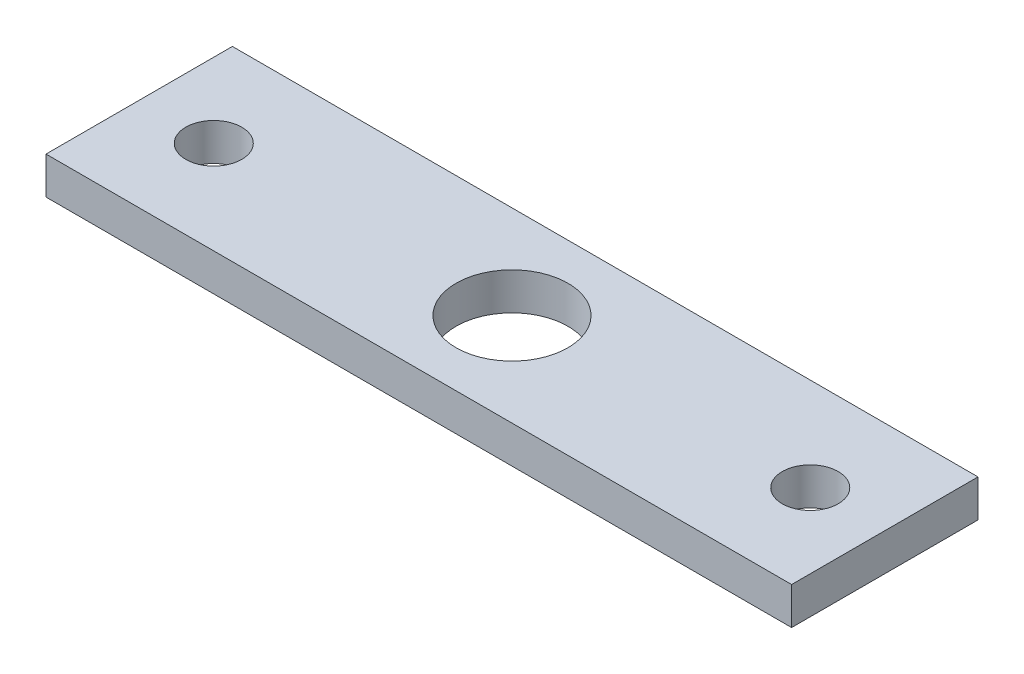
ISO-10303-21;
HEADER;
FILE_DESCRIPTION(('STEP AP214'),'2;1');
FILE_NAME('part.step','',(''),(''),'','','');
FILE_SCHEMA(('AUTOMOTIVE_DESIGN { 1 0 10303 214 1 1 1 1 }'));
ENDSEC;
DATA;
#1=APPLICATION_CONTEXT('core data for automotive mechanical design processes');
#2=APPLICATION_PROTOCOL_DEFINITION('international standard','automotive_design',2000,#1);
#3=PRODUCT_CONTEXT('',#1,'mechanical');
#4=PRODUCT('Part','Part','',(#3));
#5=PRODUCT_RELATED_PRODUCT_CATEGORY('part','',(#4));
#6=PRODUCT_DEFINITION_FORMATION('','',#4);
#7=PRODUCT_DEFINITION_CONTEXT('part definition',#1,'design');
#8=PRODUCT_DEFINITION('design','',#6,#7);
#9=PRODUCT_DEFINITION_SHAPE('','',#8);
#10=(LENGTH_UNIT() NAMED_UNIT(*) SI_UNIT(.MILLI.,.METRE.));
#11=(NAMED_UNIT(*) PLANE_ANGLE_UNIT() SI_UNIT($,.RADIAN.));
#12=(NAMED_UNIT(*) SI_UNIT($,.STERADIAN.) SOLID_ANGLE_UNIT());
#13=UNCERTAINTY_MEASURE_WITH_UNIT(LENGTH_MEASURE(1.E-05),#10,'distance_accuracy_value','');
#14=(GEOMETRIC_REPRESENTATION_CONTEXT(3) GLOBAL_UNCERTAINTY_ASSIGNED_CONTEXT((#13)) GLOBAL_UNIT_ASSIGNED_CONTEXT((#10,
#11,#12)) REPRESENTATION_CONTEXT('',''));
#15=CARTESIAN_POINT('',(0.,0.,0.));
#16=DIRECTION('',(0.,0.,1.));
#17=DIRECTION('',(1.,0.,0.));
#18=AXIS2_PLACEMENT_3D('',#15,#16,#17);
#19=CARTESIAN_POINT('',(-33.3333333333333,2.,-5.13157894736842));
#20=DIRECTION('',(1.,0.,0.));
#21=DIRECTION('',(0.,0.,-1.));
#22=AXIS2_PLACEMENT_3D('',#19,#20,#21);
#23=PLANE('',#22);
#24=DIRECTION('',(0.,0.,1.));
#25=VECTOR('',#24,1.);
#26=CARTESIAN_POINT('',(-33.3333333333333,0.,-5.13157894736842));
#27=LINE('',#26,#25);
#28=CARTESIAN_POINT('',(-33.3333333333333,0.,-5.13157894736842));
#29=VERTEX_POINT('',#28);
#30=CARTESIAN_POINT('',(-33.3333333333333,0.,4.86842105263158));
#31=VERTEX_POINT('',#30);
#32=EDGE_CURVE('E99',#29,#31,#27,.T.);
#33=ORIENTED_EDGE('',*,*,#32,.T.);
#34=DIRECTION('',(0.,-1.,0.));
#35=VECTOR('',#34,1.);
#36=CARTESIAN_POINT('',(-33.3333333333333,2.,4.86842105263158));
#37=LINE('',#36,#35);
#38=CARTESIAN_POINT('',(-33.3333333333333,2.,4.86842105263158));
#39=VERTEX_POINT('',#38);
#40=EDGE_CURVE('E11',#39,#31,#37,.T.);
#41=ORIENTED_EDGE('',*,*,#40,.F.);
#42=DIRECTION('',(0.,0.,1.));
#43=VECTOR('',#42,1.);
#44=CARTESIAN_POINT('',(-33.3333333333333,2.,-5.13157894736842));
#45=LINE('',#44,#43);
#46=CARTESIAN_POINT('',(-33.3333333333333,2.,-5.13157894736842));
#47=VERTEX_POINT('',#46);
#48=EDGE_CURVE('E87',#47,#39,#45,.T.);
#49=ORIENTED_EDGE('',*,*,#48,.F.);
#50=DIRECTION('',(0.,-1.,0.));
#51=VECTOR('',#50,1.);
#52=CARTESIAN_POINT('',(-33.3333333333333,2.,-5.13157894736842));
#53=LINE('',#52,#51);
#54=EDGE_CURVE('E95',#47,#29,#53,.T.);
#55=ORIENTED_EDGE('',*,*,#54,.T.);
#56=EDGE_LOOP('',(#33,#41,#49,#55));
#57=FACE_BOUND('',#56,.T.);
#58=ADVANCED_FACE('F36',(#57),#23,.F.);
#59=CARTESIAN_POINT('',(-33.3333333333333,2.,4.86842105263158));
#60=DIRECTION('',(0.,0.,-1.));
#61=DIRECTION('',(-1.,0.,0.));
#62=AXIS2_PLACEMENT_3D('',#59,#60,#61);
#63=PLANE('',#62);
#64=DIRECTION('',(1.,0.,0.));
#65=VECTOR('',#64,1.);
#66=CARTESIAN_POINT('',(-33.3333333333333,0.,4.86842105263158));
#67=LINE('',#66,#65);
#68=CARTESIAN_POINT('',(6.66666666666668,0.,4.86842105263158));
#69=VERTEX_POINT('',#68);
#70=EDGE_CURVE('E91',#31,#69,#67,.T.);
#71=ORIENTED_EDGE('',*,*,#70,.T.);
#72=DIRECTION('',(0.,-1.,0.));
#73=VECTOR('',#72,1.);
#74=CARTESIAN_POINT('',(6.66666666666668,2.,4.86842105263158));
#75=LINE('',#74,#73);
#76=CARTESIAN_POINT('',(6.66666666666668,2.,4.86842105263158));
#77=VERTEX_POINT('',#76);
#78=EDGE_CURVE('E44',#77,#69,#75,.T.);
#79=ORIENTED_EDGE('',*,*,#78,.F.);
#80=DIRECTION('',(1.,0.,0.));
#81=VECTOR('',#80,1.);
#82=CARTESIAN_POINT('',(-33.3333333333333,2.,4.86842105263158));
#83=LINE('',#82,#81);
#84=EDGE_CURVE('E82',#39,#77,#83,.T.);
#85=ORIENTED_EDGE('',*,*,#84,.F.);
#86=ORIENTED_EDGE('',*,*,#40,.T.);
#87=EDGE_LOOP('',(#71,#79,#85,#86));
#88=FACE_BOUND('',#87,.T.);
#89=ADVANCED_FACE('F90',(#88),#63,.F.);
#90=CARTESIAN_POINT('',(6.66666666666668,2.,-5.13157894736842));
#91=DIRECTION('',(-1.,0.,0.));
#92=DIRECTION('',(0.,0.,1.));
#93=AXIS2_PLACEMENT_3D('',#90,#91,#92);
#94=PLANE('',#93);
#95=DIRECTION('',(0.,0.,-1.));
#96=VECTOR('',#95,1.);
#97=CARTESIAN_POINT('',(6.66666666666668,0.,-5.13157894736842));
#98=LINE('',#97,#96);
#99=CARTESIAN_POINT('',(6.66666666666668,0.,-5.13157894736842));
#100=VERTEX_POINT('',#99);
#101=EDGE_CURVE('E69',#69,#100,#98,.T.);
#102=ORIENTED_EDGE('',*,*,#101,.T.);
#103=DIRECTION('',(0.,-1.,0.));
#104=VECTOR('',#103,1.);
#105=CARTESIAN_POINT('',(6.66666666666668,2.,-5.13157894736842));
#106=LINE('',#105,#104);
#107=CARTESIAN_POINT('',(6.66666666666668,2.,-5.13157894736842));
#108=VERTEX_POINT('',#107);
#109=EDGE_CURVE('E92',#108,#100,#106,.T.);
#110=ORIENTED_EDGE('',*,*,#109,.F.);
#111=DIRECTION('',(0.,0.,-1.));
#112=VECTOR('',#111,1.);
#113=CARTESIAN_POINT('',(6.66666666666668,2.,-5.13157894736842));
#114=LINE('',#113,#112);
#115=EDGE_CURVE('E85',#77,#108,#114,.T.);
#116=ORIENTED_EDGE('',*,*,#115,.F.);
#117=ORIENTED_EDGE('',*,*,#78,.T.);
#118=EDGE_LOOP('',(#102,#110,#116,#117));
#119=FACE_BOUND('',#118,.T.);
#120=ADVANCED_FACE('F93',(#119),#94,.F.);
#121=CARTESIAN_POINT('',(-33.3333333333333,2.,-5.13157894736842));
#122=DIRECTION('',(0.,0.,1.));
#123=DIRECTION('',(1.,0.,0.));
#124=AXIS2_PLACEMENT_3D('',#121,#122,#123);
#125=PLANE('',#124);
#126=DIRECTION('',(-1.,0.,0.));
#127=VECTOR('',#126,1.);
#128=CARTESIAN_POINT('',(-33.3333333333333,0.,-5.13157894736842));
#129=LINE('',#128,#127);
#130=EDGE_CURVE('E75',#100,#29,#129,.T.);
#131=ORIENTED_EDGE('',*,*,#130,.T.);
#132=ORIENTED_EDGE('',*,*,#54,.F.);
#133=DIRECTION('',(-1.,0.,0.));
#134=VECTOR('',#133,1.);
#135=CARTESIAN_POINT('',(-33.3333333333333,2.,-5.13157894736842));
#136=LINE('',#135,#134);
#137=EDGE_CURVE('E52',#108,#47,#136,.T.);
#138=ORIENTED_EDGE('',*,*,#137,.F.);
#139=ORIENTED_EDGE('',*,*,#109,.T.);
#140=EDGE_LOOP('',(#131,#132,#138,#139));
#141=FACE_BOUND('',#140,.T.);
#142=ADVANCED_FACE('F107',(#141),#125,.F.);
#143=CARTESIAN_POINT('',(0.,2.,0.));
#144=DIRECTION('',(0.,1.,0.));
#145=DIRECTION('',(0.,0.,1.));
#146=AXIS2_PLACEMENT_3D('',#143,#144,#145);
#147=PLANE('',#146);
#148=CARTESIAN_POINT('',(-29.3333333333333,2.,-0.131578947368416));
#149=DIRECTION('',(0.,1.,0.));
#150=DIRECTION('',(0.,0.,1.));
#151=AXIS2_PLACEMENT_3D('',#148,#149,#150);
#152=CIRCLE('',#151,1.5);
#153=CARTESIAN_POINT('',(-29.3333333333333,2.,1.36842105263158));
#154=VERTEX_POINT('',#153);
#155=EDGE_CURVE('E125',#154,#154,#152,.T.);
#156=ORIENTED_EDGE('',*,*,#155,.F.);
#157=EDGE_LOOP('',(#156));
#158=FACE_BOUND('',#157,.T.);
#159=CARTESIAN_POINT('',(2.66666666666668,2.,-0.131578947368416));
#160=DIRECTION('',(0.,1.,0.));
#161=DIRECTION('',(0.,0.,1.));
#162=AXIS2_PLACEMENT_3D('',#159,#160,#161);
#163=CIRCLE('',#162,1.5);
#164=CARTESIAN_POINT('',(2.66666666666668,2.,1.36842105263158));
#165=VERTEX_POINT('',#164);
#166=EDGE_CURVE('E119',#165,#165,#163,.T.);
#167=ORIENTED_EDGE('',*,*,#166,.F.);
#168=EDGE_LOOP('',(#167));
#169=FACE_BOUND('',#168,.T.);
#170=CARTESIAN_POINT('',(-13.3333333333333,2.,-0.131578947368416));
#171=DIRECTION('',(0.,1.,0.));
#172=DIRECTION('',(0.,0.,1.));
#173=AXIS2_PLACEMENT_3D('',#170,#171,#172);
#174=CIRCLE('',#173,3.);
#175=CARTESIAN_POINT('',(-13.3333333333333,2.,2.86842105263158));
#176=VERTEX_POINT('',#175);
#177=EDGE_CURVE('E113',#176,#176,#174,.T.);
#178=ORIENTED_EDGE('',*,*,#177,.F.);
#179=EDGE_LOOP('',(#178));
#180=FACE_BOUND('',#179,.T.);
#181=ORIENTED_EDGE('',*,*,#48,.T.);
#182=ORIENTED_EDGE('',*,*,#84,.T.);
#183=ORIENTED_EDGE('',*,*,#115,.T.);
#184=ORIENTED_EDGE('',*,*,#137,.T.);
#185=EDGE_LOOP('',(#181,#182,#183,#184));
#186=FACE_BOUND('',#185,.T.);
#187=ADVANCED_FACE('F83',(#158,#169,#180,#186),#147,.T.);
#188=CARTESIAN_POINT('',(0.,0.,0.));
#189=DIRECTION('',(0.,1.,0.));
#190=DIRECTION('',(0.,0.,1.));
#191=AXIS2_PLACEMENT_3D('',#188,#189,#190);
#192=PLANE('',#191);
#193=CARTESIAN_POINT('',(-29.3333333333333,0.,-0.131578947368416));
#194=DIRECTION('',(0.,1.,0.));
#195=DIRECTION('',(0.,0.,1.));
#196=AXIS2_PLACEMENT_3D('',#193,#194,#195);
#197=CIRCLE('',#196,1.5);
#198=CARTESIAN_POINT('',(-29.3333333333333,0.,1.36842105263158));
#199=VERTEX_POINT('',#198);
#200=EDGE_CURVE('E102',#199,#199,#197,.T.);
#201=ORIENTED_EDGE('',*,*,#200,.T.);
#202=EDGE_LOOP('',(#201));
#203=FACE_BOUND('',#202,.T.);
#204=CARTESIAN_POINT('',(2.66666666666668,0.,-0.131578947368416));
#205=DIRECTION('',(0.,1.,0.));
#206=DIRECTION('',(0.,0.,1.));
#207=AXIS2_PLACEMENT_3D('',#204,#205,#206);
#208=CIRCLE('',#207,1.5);
#209=CARTESIAN_POINT('',(2.66666666666668,0.,1.36842105263158));
#210=VERTEX_POINT('',#209);
#211=EDGE_CURVE('E122',#210,#210,#208,.T.);
#212=ORIENTED_EDGE('',*,*,#211,.T.);
#213=EDGE_LOOP('',(#212));
#214=FACE_BOUND('',#213,.T.);
#215=CARTESIAN_POINT('',(-13.3333333333333,0.,-0.131578947368416));
#216=DIRECTION('',(0.,1.,0.));
#217=DIRECTION('',(0.,0.,1.));
#218=AXIS2_PLACEMENT_3D('',#215,#216,#217);
#219=CIRCLE('',#218,3.);
#220=CARTESIAN_POINT('',(-13.3333333333333,0.,2.86842105263158));
#221=VERTEX_POINT('',#220);
#222=EDGE_CURVE('E116',#221,#221,#219,.T.);
#223=ORIENTED_EDGE('',*,*,#222,.T.);
#224=EDGE_LOOP('',(#223));
#225=FACE_BOUND('',#224,.T.);
#226=ORIENTED_EDGE('',*,*,#32,.F.);
#227=ORIENTED_EDGE('',*,*,#130,.F.);
#228=ORIENTED_EDGE('',*,*,#101,.F.);
#229=ORIENTED_EDGE('',*,*,#70,.F.);
#230=EDGE_LOOP('',(#226,#227,#228,#229));
#231=FACE_BOUND('',#230,.T.);
#232=ADVANCED_FACE('F110',(#203,#214,#225,#231),#192,.F.);
#233=CARTESIAN_POINT('',(-13.3333333333333,0.,-0.131578947368416));
#234=DIRECTION('',(0.,1.,0.));
#235=DIRECTION('',(0.,0.,1.));
#236=AXIS2_PLACEMENT_3D('',#233,#234,#235);
#237=CYLINDRICAL_SURFACE('',#236,3.);
#238=ORIENTED_EDGE('',*,*,#222,.F.);
#239=EDGE_LOOP('',(#238));
#240=FACE_BOUND('',#239,.T.);
#241=ORIENTED_EDGE('',*,*,#177,.T.);
#242=EDGE_LOOP('',(#241));
#243=FACE_BOUND('',#242,.T.);
#244=ADVANCED_FACE('F147',(#240,#243),#237,.F.);
#245=CARTESIAN_POINT('',(2.66666666666668,0.,-0.131578947368416));
#246=DIRECTION('',(0.,1.,0.));
#247=DIRECTION('',(0.,0.,1.));
#248=AXIS2_PLACEMENT_3D('',#245,#246,#247);
#249=CYLINDRICAL_SURFACE('',#248,1.5);
#250=ORIENTED_EDGE('',*,*,#211,.F.);
#251=EDGE_LOOP('',(#250));
#252=FACE_BOUND('',#251,.T.);
#253=ORIENTED_EDGE('',*,*,#166,.T.);
#254=EDGE_LOOP('',(#253));
#255=FACE_BOUND('',#254,.T.);
#256=ADVANCED_FACE('F136',(#252,#255),#249,.F.);
#257=CARTESIAN_POINT('',(-29.3333333333333,0.,-0.131578947368416));
#258=DIRECTION('',(0.,1.,0.));
#259=DIRECTION('',(0.,0.,1.));
#260=AXIS2_PLACEMENT_3D('',#257,#258,#259);
#261=CYLINDRICAL_SURFACE('',#260,1.5);
#262=ORIENTED_EDGE('',*,*,#200,.F.);
#263=EDGE_LOOP('',(#262));
#264=FACE_BOUND('',#263,.T.);
#265=ORIENTED_EDGE('',*,*,#155,.T.);
#266=EDGE_LOOP('',(#265));
#267=FACE_BOUND('',#266,.T.);
#268=ADVANCED_FACE('F133',(#264,#267),#261,.F.);
#269=CLOSED_SHELL('',(#58,#89,#120,#142,#187,#232,#244,#256,#268));
#270=MANIFOLD_SOLID_BREP('B2',#269);
#271=ADVANCED_BREP_SHAPE_REPRESENTATION('',(#18,#270),#14);
#272=SHAPE_DEFINITION_REPRESENTATION(#9,#271);
ENDSEC;
END-ISO-10303-21;
